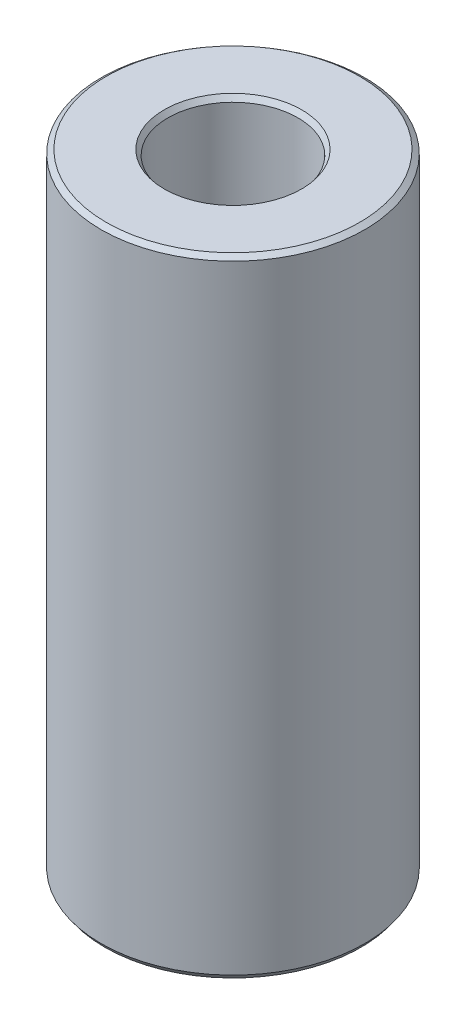
ISO-10303-21;
HEADER;
FILE_DESCRIPTION(('STEP AP214'),'2;1');
FILE_NAME('part.step','',(''),(''),'','','');
FILE_SCHEMA(('AUTOMOTIVE_DESIGN { 1 0 10303 214 1 1 1 1 }'));
ENDSEC;
DATA;
#1=APPLICATION_CONTEXT('core data for automotive mechanical design processes');
#2=APPLICATION_PROTOCOL_DEFINITION('international standard','automotive_design',2000,#1);
#3=PRODUCT_CONTEXT('',#1,'mechanical');
#4=PRODUCT('Part','Part','',(#3));
#5=PRODUCT_RELATED_PRODUCT_CATEGORY('part','',(#4));
#6=PRODUCT_DEFINITION_FORMATION('','',#4);
#7=PRODUCT_DEFINITION_CONTEXT('part definition',#1,'design');
#8=PRODUCT_DEFINITION('design','',#6,#7);
#9=PRODUCT_DEFINITION_SHAPE('','',#8);
#10=(LENGTH_UNIT() NAMED_UNIT(*) SI_UNIT(.MILLI.,.METRE.));
#11=(NAMED_UNIT(*) PLANE_ANGLE_UNIT() SI_UNIT($,.RADIAN.));
#12=(NAMED_UNIT(*) SI_UNIT($,.STERADIAN.) SOLID_ANGLE_UNIT());
#13=UNCERTAINTY_MEASURE_WITH_UNIT(LENGTH_MEASURE(1.E-05),#10,'distance_accuracy_value','');
#14=(GEOMETRIC_REPRESENTATION_CONTEXT(3) GLOBAL_UNCERTAINTY_ASSIGNED_CONTEXT((#13)) GLOBAL_UNIT_ASSIGNED_CONTEXT((#10,
#11,#12)) REPRESENTATION_CONTEXT('',''));
#15=CARTESIAN_POINT('',(0.,0.,0.));
#16=DIRECTION('',(0.,0.,1.));
#17=DIRECTION('',(1.,0.,0.));
#18=AXIS2_PLACEMENT_3D('',#15,#16,#17);
#19=CARTESIAN_POINT('',(0.,178.489777708235,0.));
#20=DIRECTION('',(0.,-1.,0.));
#21=DIRECTION('',(0.,0.,-1.));
#22=AXIS2_PLACEMENT_3D('',#19,#20,#21);
#23=CYLINDRICAL_SURFACE('',#22,37.5);
#24=CARTESIAN_POINT('',(0.,1.45913410106016,0.));
#25=DIRECTION('',(0.,1.,0.));
#26=DIRECTION('',(0.,0.,1.));
#27=AXIS2_PLACEMENT_3D('',#24,#25,#26);
#28=CIRCLE('',#27,37.5);
#29=CARTESIAN_POINT('',(0.,1.45913410106016,37.5));
#30=VERTEX_POINT('',#29);
#31=EDGE_CURVE('E10',#30,#30,#28,.T.);
#32=ORIENTED_EDGE('',*,*,#31,.T.);
#33=EDGE_LOOP('',(#32));
#34=FACE_BOUND('',#33,.T.);
#35=CARTESIAN_POINT('',(0.,177.43095691076,0.));
#36=DIRECTION('',(0.,1.,0.));
#37=DIRECTION('',(0.,0.,1.));
#38=AXIS2_PLACEMENT_3D('',#35,#36,#37);
#39=CIRCLE('',#38,37.5);
#40=CARTESIAN_POINT('',(0.,177.43095691076,37.5));
#41=VERTEX_POINT('',#40);
#42=EDGE_CURVE('E50',#41,#41,#39,.F.);
#43=ORIENTED_EDGE('',*,*,#42,.T.);
#44=EDGE_LOOP('',(#43));
#45=FACE_BOUND('',#44,.T.);
#46=ADVANCED_FACE('F39',(#34,#45),#23,.T.);
#47=CARTESIAN_POINT('',(0.,178.489777708235,0.));
#48=DIRECTION('',(0.,1.,0.));
#49=DIRECTION('',(0.,0.,1.));
#50=AXIS2_PLACEMENT_3D('',#47,#48,#49);
#51=PLANE('',#50);
#52=CARTESIAN_POINT('',(0.,178.489777708235,0.));
#53=DIRECTION('',(0.,1.,0.));
#54=DIRECTION('',(0.,0.,1.));
#55=AXIS2_PLACEMENT_3D('',#52,#53,#54);
#56=CIRCLE('',#55,19.5545300594673);
#57=CARTESIAN_POINT('',(0.,178.489777708235,19.5545300594673));
#58=VERTEX_POINT('',#57);
#59=EDGE_CURVE('E58',#58,#58,#56,.F.);
#60=ORIENTED_EDGE('',*,*,#59,.T.);
#61=EDGE_LOOP('',(#60));
#62=FACE_BOUND('',#61,.T.);
#63=CARTESIAN_POINT('',(0.,178.489777708235,0.));
#64=DIRECTION('',(0.,1.,0.));
#65=DIRECTION('',(0.,0.,1.));
#66=AXIS2_PLACEMENT_3D('',#63,#64,#65);
#67=CIRCLE('',#66,36.0408658989398);
#68=CARTESIAN_POINT('',(0.,178.489777708235,36.0408658989398));
#69=VERTEX_POINT('',#68);
#70=EDGE_CURVE('E61',#69,#69,#67,.T.);
#71=ORIENTED_EDGE('',*,*,#70,.T.);
#72=EDGE_LOOP('',(#71));
#73=FACE_BOUND('',#72,.T.);
#74=ADVANCED_FACE('F88',(#62,#73),#51,.T.);
#75=CARTESIAN_POINT('',(0.,0.,0.));
#76=DIRECTION('',(0.,1.,0.));
#77=DIRECTION('',(0.,0.,1.));
#78=AXIS2_PLACEMENT_3D('',#75,#76,#77);
#79=PLANE('',#78);
#80=CARTESIAN_POINT('',(0.,0.,0.));
#81=DIRECTION('',(0.,1.,0.));
#82=DIRECTION('',(0.,0.,1.));
#83=AXIS2_PLACEMENT_3D('',#80,#81,#82);
#84=CIRCLE('',#83,19.9548433630533);
#85=CARTESIAN_POINT('',(0.,0.,19.9548433630533));
#86=VERTEX_POINT('',#85);
#87=EDGE_CURVE('E51',#86,#86,#84,.T.);
#88=ORIENTED_EDGE('',*,*,#87,.T.);
#89=EDGE_LOOP('',(#88));
#90=FACE_BOUND('',#89,.T.);
#91=CARTESIAN_POINT('',(0.,0.,0.));
#92=DIRECTION('',(0.,1.,0.));
#93=DIRECTION('',(0.,0.,1.));
#94=AXIS2_PLACEMENT_3D('',#91,#92,#93);
#95=CIRCLE('',#94,36.4411792025257);
#96=CARTESIAN_POINT('',(0.,0.,36.4411792025257));
#97=VERTEX_POINT('',#96);
#98=EDGE_CURVE('E54',#97,#97,#95,.F.);
#99=ORIENTED_EDGE('',*,*,#98,.T.);
#100=EDGE_LOOP('',(#99));
#101=FACE_BOUND('',#100,.T.);
#102=ADVANCED_FACE('F83',(#90,#101),#79,.F.);
#103=CARTESIAN_POINT('',(0.,178.489777708235,0.));
#104=DIRECTION('',(0.,-1.,0.));
#105=DIRECTION('',(0.,0.,-1.));
#106=AXIS2_PLACEMENT_3D('',#103,#104,#105);
#107=CYLINDRICAL_SURFACE('',#106,18.495709261993);
#108=CARTESIAN_POINT('',(0.,177.030643607174,0.));
#109=DIRECTION('',(0.,1.,0.));
#110=DIRECTION('',(0.,0.,1.));
#111=AXIS2_PLACEMENT_3D('',#108,#109,#110);
#112=CIRCLE('',#111,18.495709261993);
#113=CARTESIAN_POINT('',(0.,177.030643607174,18.495709261993));
#114=VERTEX_POINT('',#113);
#115=EDGE_CURVE('E67',#114,#114,#112,.T.);
#116=ORIENTED_EDGE('',*,*,#115,.T.);
#117=EDGE_LOOP('',(#116));
#118=FACE_BOUND('',#117,.T.);
#119=CARTESIAN_POINT('',(0.,1.0588207974743,0.));
#120=DIRECTION('',(0.,1.,0.));
#121=DIRECTION('',(0.,0.,1.));
#122=AXIS2_PLACEMENT_3D('',#119,#120,#121);
#123=CIRCLE('',#122,18.495709261993);
#124=CARTESIAN_POINT('',(0.,1.0588207974743,18.495709261993));
#125=VERTEX_POINT('',#124);
#126=EDGE_CURVE('E69',#125,#125,#123,.F.);
#127=ORIENTED_EDGE('',*,*,#126,.T.);
#128=EDGE_LOOP('',(#127));
#129=FACE_BOUND('',#128,.T.);
#130=ADVANCED_FACE('F71',(#118,#129),#107,.F.);
#131=CARTESIAN_POINT('',(0.,177.030643607174,0.));
#132=DIRECTION('',(0.,1.,0.));
#133=DIRECTION('',(0.,0.,1.));
#134=AXIS2_PLACEMENT_3D('',#131,#132,#133);
#135=CONICAL_SURFACE('',#134,18.495709261993,0.627734177104935);
#136=CARTESIAN_POINT('',(0.,178.489777708235,19.5545300594673));
#137=CARTESIAN_POINT('',(0.,178.474578394682,19.5435006761603));
#138=CARTESIAN_POINT('',(0.,178.459379081129,19.5324712928532));
#139=CARTESIAN_POINT('',(0.,178.428980454024,19.5104125262392));
#140=CARTESIAN_POINT('',(0.,178.413781140471,19.4993831429322));
#141=CARTESIAN_POINT('',(0.,178.383382513366,19.4773243763181));
#142=CARTESIAN_POINT('',(0.,178.368183199813,19.4662949930111));
#143=CARTESIAN_POINT('',(0.,178.337784572708,19.444236226397));
#144=CARTESIAN_POINT('',(0.,178.322585259155,19.43320684309));
#145=CARTESIAN_POINT('',(0.,178.292186632049,19.411148076476));
#146=CARTESIAN_POINT('',(0.,178.276987318497,19.4001186931689));
#147=CARTESIAN_POINT('',(0.,178.246588691391,19.3780599265549));
#148=CARTESIAN_POINT('',(0.,178.231389377839,19.3670305432479));
#149=CARTESIAN_POINT('',(0.,178.200990750733,19.3449717766338));
#150=CARTESIAN_POINT('',(0.,178.18579143718,19.3339423933268));
#151=CARTESIAN_POINT('',(0.,178.155392810075,19.3118836267128));
#152=CARTESIAN_POINT('',(0.,178.140193496522,19.3008542434057));
#153=CARTESIAN_POINT('',(0.,178.109794869417,19.2787954767917));
#154=CARTESIAN_POINT('',(0.,178.094595555864,19.2677660934847));
#155=CARTESIAN_POINT('',(0.,178.064196928759,19.2457073268706));
#156=CARTESIAN_POINT('',(0.,178.048997615206,19.2346779435636));
#157=CARTESIAN_POINT('',(0.,178.018598988101,19.2126191769496));
#158=CARTESIAN_POINT('',(0.,178.003399674548,19.2015897936425));
#159=CARTESIAN_POINT('',(0.,177.973001047442,19.1795310270285));
#160=CARTESIAN_POINT('',(0.,177.95780173389,19.1685016437215));
#161=CARTESIAN_POINT('',(0.,177.927403106784,19.1464428771074));
#162=CARTESIAN_POINT('',(0.,177.912203793232,19.1354134938004));
#163=CARTESIAN_POINT('',(0.,177.881805166126,19.1133547271863));
#164=CARTESIAN_POINT('',(0.,177.866605852573,19.1023253438793));
#165=CARTESIAN_POINT('',(0.,177.836207225468,19.0802665772653));
#166=CARTESIAN_POINT('',(0.,177.821007911915,19.0692371939582));
#167=CARTESIAN_POINT('',(0.,177.79060928481,19.0471784273442));
#168=CARTESIAN_POINT('',(0.,177.775409971257,19.0361490440372));
#169=CARTESIAN_POINT('',(0.,177.745011344152,19.0140902774231));
#170=CARTESIAN_POINT('',(0.,177.729812030599,19.0030608941161));
#171=CARTESIAN_POINT('',(0.,177.699413403494,18.9810021275021));
#172=CARTESIAN_POINT('',(0.,177.684214089941,18.969972744195));
#173=CARTESIAN_POINT('',(0.,177.653815462836,18.947913977581));
#174=CARTESIAN_POINT('',(0.,177.638616149283,18.936884594274));
#175=CARTESIAN_POINT('',(0.,177.608217522177,18.9148258276599));
#176=CARTESIAN_POINT('',(0.,177.593018208625,18.9037964443529));
#177=CARTESIAN_POINT('',(0.,177.562619581519,18.8817376777388));
#178=CARTESIAN_POINT('',(0.,177.547420267967,18.8707082944318));
#179=CARTESIAN_POINT('',(0.,177.517021640861,18.8486495278178));
#180=CARTESIAN_POINT('',(0.,177.501822327308,18.8376201445108));
#181=CARTESIAN_POINT('',(0.,177.471423700203,18.8155613778967));
#182=CARTESIAN_POINT('',(0.,177.45622438665,18.8045319945897));
#183=CARTESIAN_POINT('',(0.,177.425825759545,18.7824732279756));
#184=CARTESIAN_POINT('',(0.,177.410626445992,18.7714438446686));
#185=CARTESIAN_POINT('',(0.,177.380227818887,18.7493850780546));
#186=CARTESIAN_POINT('',(0.,177.365028505334,18.7383556947475));
#187=CARTESIAN_POINT('',(0.,177.334629878229,18.7162969281335));
#188=CARTESIAN_POINT('',(0.,177.319430564676,18.7052675448265));
#189=CARTESIAN_POINT('',(0.,177.289031937571,18.6832087782124));
#190=CARTESIAN_POINT('',(0.,177.273832624018,18.6721793949054));
#191=CARTESIAN_POINT('',(0.,177.243433996912,18.6501206282914));
#192=CARTESIAN_POINT('',(0.,177.22823468336,18.6390912449843));
#193=CARTESIAN_POINT('',(0.,177.197836056254,18.6170324783703));
#194=CARTESIAN_POINT('',(0.,177.182636742702,18.6060030950633));
#195=CARTESIAN_POINT('',(0.,177.152238115596,18.5839443284492));
#196=CARTESIAN_POINT('',(0.,177.137038802043,18.5729149451422));
#197=CARTESIAN_POINT('',(0.,177.106640174938,18.5508561785281));
#198=CARTESIAN_POINT('',(0.,177.091440861385,18.5398267952211));
#199=CARTESIAN_POINT('',(0.,177.06104223428,18.5177680286071));
#200=CARTESIAN_POINT('',(0.,177.045842920727,18.5067386453001));
#201=CARTESIAN_POINT('',(0.,177.030643607174,18.495709261993));
#202=B_SPLINE_CURVE_WITH_KNOTS('',3,(#136,#137,#138,#139,#140,#141,#142,#143,#144,#145,#146,
#147,#148,#149,#150,#151,#152,#153,#154,#155,#156,#157,#158,#159,#160,#161,#162,#163,#164,#165,
#166,#167,#168,#169,#170,#171,#172,#173,#174,#175,#176,#177,#178,#179,#180,#181,#182,#183,#184,
#185,#186,#187,#188,#189,#190,#191,#192,#193,#194,#195,#196,#197,#198,#199,#200,#201),
.UNSPECIFIED.,.F.,.F.,(4,2,2,2,2,2,2,2,2,2,2,2,2,2,2,2,2,2,2,2,2,2,2,2,2,2,2,2,2,2,2,2,4),(0.,
0.0563382450690708,0.112676490138144,0.169014735207192,0.225352980276265,0.281691225345313,
0.338029470414384,0.394367715483435,0.450705960552505,0.507044205621556,0.563382450690627,
0.619720695759677,0.676058940828748,0.732397185897798,0.788735430966869,0.845073676035917,
0.90141192110499,0.957750166174061,1.01408841124311,1.07042665631218,1.12676490138123,
1.1831031464503,1.23944139151935,1.29577963658842,1.35211788165747,1.40845612672655,
1.46479437179559,1.52113261686467,1.57747086193372,1.63380910700279,1.69014735207184,
1.74648559714091,1.80282384220996),.UNSPECIFIED.);
#203=EDGE_CURVE('BSEAM77',#58,#114,#202,.T.);
#204=ORIENTED_EDGE('',*,*,#59,.F.);
#205=ORIENTED_EDGE('',*,*,#115,.F.);
#206=ORIENTED_EDGE('',*,*,#203,.T.);
#207=ORIENTED_EDGE('',*,*,#203,.F.);
#208=EDGE_LOOP('',(#204,#206,#205,#207));
#209=FACE_BOUND('',#208,.T.);
#210=ADVANCED_FACE('F77',(#209),#135,.F.);
#211=CARTESIAN_POINT('',(0.,0.,0.));
#212=DIRECTION('',(0.,-1.,0.));
#213=DIRECTION('',(0.,0.,-1.));
#214=AXIS2_PLACEMENT_3D('',#211,#212,#213);
#215=CONICAL_SURFACE('',#214,19.9548433630533,0.943062149689966);
#216=ORIENTED_EDGE('',*,*,#126,.F.);
#217=EDGE_LOOP('',(#216));
#218=FACE_BOUND('',#217,.T.);
#219=ORIENTED_EDGE('',*,*,#87,.F.);
#220=EDGE_LOOP('',(#219));
#221=FACE_BOUND('',#220,.T.);
#222=ADVANCED_FACE('F73',(#218,#221),#215,.F.);
#223=CARTESIAN_POINT('',(0.,1.45913410106016,0.));
#224=DIRECTION('',(0.,1.,0.));
#225=DIRECTION('',(0.,0.,1.));
#226=AXIS2_PLACEMENT_3D('',#223,#224,#225);
#227=CONICAL_SURFACE('',#226,37.5,0.627734177104938);
#228=CARTESIAN_POINT('',(0.,0.,36.4411792025257));
#229=CARTESIAN_POINT('',(0.,0.015199313552709,36.4522085858328));
#230=CARTESIAN_POINT('',(0.,0.0303986271054194,36.4632379691398));
#231=CARTESIAN_POINT('',(0.,0.0607972542108402,36.4852967357538));
#232=CARTESIAN_POINT('',(0.,0.0759965677635506,36.4963261190609));
#233=CARTESIAN_POINT('',(0.,0.10639519486897,36.5183848856749));
#234=CARTESIAN_POINT('',(0.,0.121594508421679,36.5294142689819));
#235=CARTESIAN_POINT('',(0.,0.151993135527099,36.551473035596));
#236=CARTESIAN_POINT('',(0.,0.16719244907981,36.562502418903));
#237=CARTESIAN_POINT('',(0.,0.19759107618523,36.584561185517));
#238=CARTESIAN_POINT('',(0.,0.21279038973794,36.5955905688241));
#239=CARTESIAN_POINT('',(0.,0.24318901684336,36.6176493354381));
#240=CARTESIAN_POINT('',(0.,0.258388330396071,36.6286787187451));
#241=CARTESIAN_POINT('',(0.,0.28878695750149,36.6507374853592));
#242=CARTESIAN_POINT('',(0.,0.3039862710542,36.6617668686662));
#243=CARTESIAN_POINT('',(0.,0.334384898159619,36.6838256352803));
#244=CARTESIAN_POINT('',(0.,0.34958421171233,36.6948550185873));
#245=CARTESIAN_POINT('',(0.,0.37998283881775,36.7169137852013));
#246=CARTESIAN_POINT('',(0.,0.39518215237046,36.7279431685084));
#247=CARTESIAN_POINT('',(0.,0.42558077947588,36.7500019351224));
#248=CARTESIAN_POINT('',(0.,0.440780093028591,36.7610313184294));
#249=CARTESIAN_POINT('',(0.,0.471178720134011,36.7830900850435));
#250=CARTESIAN_POINT('',(0.,0.48637803368672,36.7941194683505));
#251=CARTESIAN_POINT('',(0.,0.516776660792139,36.8161782349645));
#252=CARTESIAN_POINT('',(0.,0.53197597434485,36.8272076182716));
#253=CARTESIAN_POINT('',(0.,0.562374601450271,36.8492663848856));
#254=CARTESIAN_POINT('',(0.,0.57757391500298,36.8602957681926));
#255=CARTESIAN_POINT('',(0.,0.6079725421084,36.8823545348067));
#256=CARTESIAN_POINT('',(0.,0.623171855661111,36.8933839181137));
#257=CARTESIAN_POINT('',(0.,0.653570482766531,36.9154426847278));
#258=CARTESIAN_POINT('',(0.,0.66876979631924,36.9264720680348));
#259=CARTESIAN_POINT('',(0.,0.69916842342466,36.9485308346488));
#260=CARTESIAN_POINT('',(0.,0.71436773697737,36.9595602179558));
#261=CARTESIAN_POINT('',(0.,0.744766364082791,36.9816189845699));
#262=CARTESIAN_POINT('',(0.,0.7599656776355,36.9926483678769));
#263=CARTESIAN_POINT('',(0.,0.790364304740921,37.014707134491));
#264=CARTESIAN_POINT('',(0.,0.805563618293631,37.025736517798));
#265=CARTESIAN_POINT('',(0.,0.835962245399051,37.047795284412));
#266=CARTESIAN_POINT('',(0.,0.85116155895176,37.0588246677191));
#267=CARTESIAN_POINT('',(0.,0.88156018605718,37.0808834343331));
#268=CARTESIAN_POINT('',(0.,0.89675949960989,37.0919128176401));
#269=CARTESIAN_POINT('',(0.,0.927158126715311,37.1139715842542));
#270=CARTESIAN_POINT('',(0.,0.94235744026802,37.1250009675612));
#271=CARTESIAN_POINT('',(0.,0.972756067373441,37.1470597341752));
#272=CARTESIAN_POINT('',(0.,0.987955380926151,37.1580891174823));
#273=CARTESIAN_POINT('',(0.,1.01835400803157,37.1801478840963));
#274=CARTESIAN_POINT('',(0.,1.03355332158428,37.1911772674033));
#275=CARTESIAN_POINT('',(0.,1.0639519486897,37.2132360340174));
#276=CARTESIAN_POINT('',(0.,1.07915126224241,37.2242654173244));
#277=CARTESIAN_POINT('',(0.,1.10954988934783,37.2463241839385));
#278=CARTESIAN_POINT('',(0.,1.12474920290054,37.2573535672455));
#279=CARTESIAN_POINT('',(0.,1.15514783000596,37.2794123338595));
#280=CARTESIAN_POINT('',(0.,1.17034714355867,37.2904417171666));
#281=CARTESIAN_POINT('',(0.,1.20074577066409,37.3125004837806));
#282=CARTESIAN_POINT('',(0.,1.2159450842168,37.3235298670876));
#283=CARTESIAN_POINT('',(0.,1.24634371132222,37.3455886337017));
#284=CARTESIAN_POINT('',(0.,1.26154302487493,37.3566180170087));
#285=CARTESIAN_POINT('',(0.,1.29194165198035,37.3786767836227));
#286=CARTESIAN_POINT('',(0.,1.30714096553306,37.3897061669298));
#287=CARTESIAN_POINT('',(0.,1.33753959263848,37.4117649335438));
#288=CARTESIAN_POINT('',(0.,1.35273890619119,37.4227943168508));
#289=CARTESIAN_POINT('',(0.,1.38313753329661,37.4448530834649));
#290=CARTESIAN_POINT('',(0.,1.39833684684932,37.4558824667719));
#291=CARTESIAN_POINT('',(0.,1.42873547395474,37.477941233386));
#292=CARTESIAN_POINT('',(0.,1.44393478750745,37.488970616693));
#293=CARTESIAN_POINT('',(0.,1.45913410106016,37.5));
#294=B_SPLINE_CURVE_WITH_KNOTS('',3,(#228,#229,#230,#231,#232,#233,#234,#235,#236,#237,#238,
#239,#240,#241,#242,#243,#244,#245,#246,#247,#248,#249,#250,#251,#252,#253,#254,#255,#256,#257,
#258,#259,#260,#261,#262,#263,#264,#265,#266,#267,#268,#269,#270,#271,#272,#273,#274,#275,#276,
#277,#278,#279,#280,#281,#282,#283,#284,#285,#286,#287,#288,#289,#290,#291,#292,#293),
.UNSPECIFIED.,.F.,.F.,(4,2,2,2,2,2,2,2,2,2,2,2,2,2,2,2,2,2,2,2,2,2,2,2,2,2,2,2,2,2,2,2,4),(0.,
0.0563382450690603,0.112676490138121,0.169014735207185,0.225352980276245,0.281691225345306,
0.338029470414366,0.39436771548343,0.450705960552491,0.507044205621551,0.563382450690611,
0.619720695759676,0.676058940828736,0.732397185897796,0.788735430966856,0.845073676035921,
0.901411921104981,0.957750166174042,1.0140884112431,1.07042665631217,1.12676490138123,
1.18310314645029,1.23944139151935,1.29577963658841,1.35211788165747,1.40845612672653,
1.46479437179559,1.52113261686466,1.57747086193372,1.63380910700278,1.69014735207184,
1.7464855971409,1.80282384220996),.UNSPECIFIED.);
#295=EDGE_CURVE('BSEAM76',#97,#30,#294,.T.);
#296=ORIENTED_EDGE('',*,*,#98,.F.);
#297=ORIENTED_EDGE('',*,*,#31,.F.);
#298=ORIENTED_EDGE('',*,*,#295,.T.);
#299=ORIENTED_EDGE('',*,*,#295,.F.);
#300=EDGE_LOOP('',(#296,#298,#297,#299));
#301=FACE_BOUND('',#300,.T.);
#302=ADVANCED_FACE('F76',(#301),#227,.T.);
#303=CARTESIAN_POINT('',(0.,178.489777708235,0.));
#304=DIRECTION('',(0.,-1.,0.));
#305=DIRECTION('',(0.,0.,-1.));
#306=AXIS2_PLACEMENT_3D('',#303,#304,#305);
#307=CONICAL_SURFACE('',#306,36.0408658989398,0.943062149689955);
#308=ORIENTED_EDGE('',*,*,#42,.F.);
#309=EDGE_LOOP('',(#308));
#310=FACE_BOUND('',#309,.T.);
#311=ORIENTED_EDGE('',*,*,#70,.F.);
#312=EDGE_LOOP('',(#311));
#313=FACE_BOUND('',#312,.T.);
#314=ADVANCED_FACE('F45',(#310,#313),#307,.T.);
#315=CLOSED_SHELL('',(#46,#74,#102,#130,#210,#222,#302,#314));
#316=MANIFOLD_SOLID_BREP('B2',#315);
#317=ADVANCED_BREP_SHAPE_REPRESENTATION('',(#18,#316),#14);
#318=SHAPE_DEFINITION_REPRESENTATION(#9,#317);
ENDSEC;
END-ISO-10303-21;
